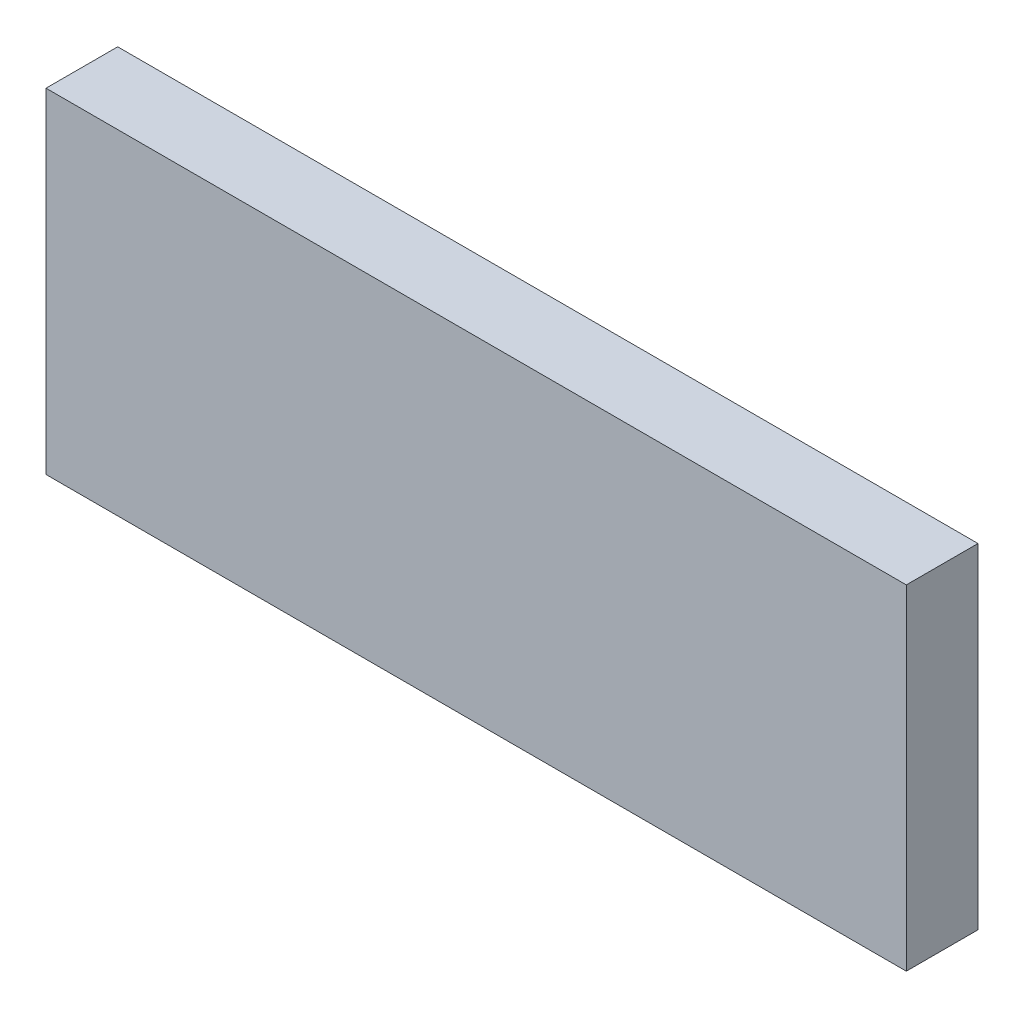
ISO-10303-21;
HEADER;
FILE_DESCRIPTION(('STEP AP214'),'2;1');
FILE_NAME('part.step','',(''),(''),'','','');
FILE_SCHEMA(('AUTOMOTIVE_DESIGN { 1 0 10303 214 1 1 1 1 }'));
ENDSEC;
DATA;
#1=APPLICATION_CONTEXT('core data for automotive mechanical design processes');
#2=APPLICATION_PROTOCOL_DEFINITION('international standard','automotive_design',2000,#1);
#3=PRODUCT_CONTEXT('',#1,'mechanical');
#4=PRODUCT('Part','Part','',(#3));
#5=PRODUCT_RELATED_PRODUCT_CATEGORY('part','',(#4));
#6=PRODUCT_DEFINITION_FORMATION('','',#4);
#7=PRODUCT_DEFINITION_CONTEXT('part definition',#1,'design');
#8=PRODUCT_DEFINITION('design','',#6,#7);
#9=PRODUCT_DEFINITION_SHAPE('','',#8);
#10=(LENGTH_UNIT() NAMED_UNIT(*) SI_UNIT(.MILLI.,.METRE.));
#11=(NAMED_UNIT(*) PLANE_ANGLE_UNIT() SI_UNIT($,.RADIAN.));
#12=(NAMED_UNIT(*) SI_UNIT($,.STERADIAN.) SOLID_ANGLE_UNIT());
#13=UNCERTAINTY_MEASURE_WITH_UNIT(LENGTH_MEASURE(1.E-05),#10,'distance_accuracy_value','');
#14=(GEOMETRIC_REPRESENTATION_CONTEXT(3) GLOBAL_UNCERTAINTY_ASSIGNED_CONTEXT((#13)) GLOBAL_UNIT_ASSIGNED_CONTEXT((#10,
#11,#12)) REPRESENTATION_CONTEXT('',''));
#15=CARTESIAN_POINT('',(0.,0.,0.));
#16=DIRECTION('',(0.,0.,1.));
#17=DIRECTION('',(1.,0.,0.));
#18=AXIS2_PLACEMENT_3D('',#15,#16,#17);
#19=CARTESIAN_POINT('',(1.270000012657E-06,0.,0.1499997));
#20=DIRECTION('',(0.,0.,1.));
#21=DIRECTION('',(1.,0.,0.));
#22=AXIS2_PLACEMENT_3D('',#19,#20,#21);
#23=PLANE('',#22);
#24=DIRECTION('',(-3.62857872202151E-06,0.999999999993417,0.));
#25=VECTOR('',#24,1.);
#26=CARTESIAN_POINT('',(0.90000328,-0.3499993,0.1499997));
#27=LINE('',#26,#25);
#28=CARTESIAN_POINT('',(0.90000328,-0.3499993,0.1499997));
#29=VERTEX_POINT('',#28);
#30=CARTESIAN_POINT('',(0.90000074,0.3499993,0.1499997));
#31=VERTEX_POINT('',#30);
#32=EDGE_CURVE('E86',#29,#31,#27,.T.);
#33=ORIENTED_EDGE('',*,*,#32,.T.);
#34=DIRECTION('',(-1.,0.,0.));
#35=VECTOR('',#34,1.);
#36=CARTESIAN_POINT('',(0.90000074,0.3499993,0.1499997));
#37=LINE('',#36,#35);
#38=CARTESIAN_POINT('',(-0.90000074,0.3499993,0.1499997));
#39=VERTEX_POINT('',#38);
#40=EDGE_CURVE('E75',#31,#39,#37,.T.);
#41=ORIENTED_EDGE('',*,*,#40,.T.);
#42=DIRECTION('',(3.62857872202151E-06,-0.999999999993417,0.));
#43=VECTOR('',#42,1.);
#44=CARTESIAN_POINT('',(-0.90000074,0.3499993,0.1499997));
#45=LINE('',#44,#43);
#46=CARTESIAN_POINT('',(-0.8999982,-0.3499993,0.1499997));
#47=VERTEX_POINT('',#46);
#48=EDGE_CURVE('E108',#39,#47,#45,.T.);
#49=ORIENTED_EDGE('',*,*,#48,.T.);
#50=DIRECTION('',(1.,0.,0.));
#51=VECTOR('',#50,1.);
#52=CARTESIAN_POINT('',(-0.8999982,-0.3499993,0.1499997));
#53=LINE('',#52,#51);
#54=EDGE_CURVE('E11',#47,#29,#53,.T.);
#55=ORIENTED_EDGE('',*,*,#54,.T.);
#56=EDGE_LOOP('',(#33,#41,#49,#55));
#57=FACE_BOUND('',#56,.T.);
#58=ADVANCED_FACE('F16',(#57),#23,.T.);
#59=CARTESIAN_POINT('',(1.270000012657E-06,0.,0.));
#60=DIRECTION('',(0.,0.,1.));
#61=DIRECTION('',(1.,0.,0.));
#62=AXIS2_PLACEMENT_3D('',#59,#60,#61);
#63=PLANE('',#62);
#64=DIRECTION('',(-3.62857872202151E-06,0.999999999993417,0.));
#65=VECTOR('',#64,1.);
#66=CARTESIAN_POINT('',(0.90000328,-0.3499993,0.));
#67=LINE('',#66,#65);
#68=CARTESIAN_POINT('',(0.90000328,-0.3499993,0.));
#69=VERTEX_POINT('',#68);
#70=CARTESIAN_POINT('',(0.90000074,0.3499993,0.));
#71=VERTEX_POINT('',#70);
#72=EDGE_CURVE('E92',#69,#71,#67,.T.);
#73=ORIENTED_EDGE('',*,*,#72,.F.);
#74=DIRECTION('',(1.,0.,0.));
#75=VECTOR('',#74,1.);
#76=CARTESIAN_POINT('',(-0.8999982,-0.3499993,0.));
#77=LINE('',#76,#75);
#78=CARTESIAN_POINT('',(-0.8999982,-0.3499993,0.));
#79=VERTEX_POINT('',#78);
#80=EDGE_CURVE('E20',#79,#69,#77,.T.);
#81=ORIENTED_EDGE('',*,*,#80,.F.);
#82=DIRECTION('',(3.62857872202151E-06,-0.999999999993417,0.));
#83=VECTOR('',#82,1.);
#84=CARTESIAN_POINT('',(-0.90000074,0.3499993,0.));
#85=LINE('',#84,#83);
#86=CARTESIAN_POINT('',(-0.90000074,0.3499993,0.));
#87=VERTEX_POINT('',#86);
#88=EDGE_CURVE('E84',#87,#79,#85,.T.);
#89=ORIENTED_EDGE('',*,*,#88,.F.);
#90=DIRECTION('',(-1.,0.,0.));
#91=VECTOR('',#90,1.);
#92=CARTESIAN_POINT('',(0.90000074,0.3499993,0.));
#93=LINE('',#92,#91);
#94=EDGE_CURVE('E90',#71,#87,#93,.T.);
#95=ORIENTED_EDGE('',*,*,#94,.F.);
#96=EDGE_LOOP('',(#73,#81,#89,#95));
#97=FACE_BOUND('',#96,.T.);
#98=ADVANCED_FACE('F119',(#97),#63,.F.);
#99=CARTESIAN_POINT('',(-0.8999982,-0.3499993,0.));
#100=DIRECTION('',(0.,1.,0.));
#101=DIRECTION('',(1.,0.,0.));
#102=AXIS2_PLACEMENT_3D('',#99,#100,#101);
#103=PLANE('',#102);
#104=DIRECTION('',(0.,0.,1.));
#105=VECTOR('',#104,1.);
#106=CARTESIAN_POINT('',(-0.8999982,-0.3499993,0.));
#107=LINE('',#106,#105);
#108=EDGE_CURVE('E105',#79,#47,#107,.T.);
#109=ORIENTED_EDGE('',*,*,#108,.F.);
#110=ORIENTED_EDGE('',*,*,#80,.T.);
#111=DIRECTION('',(0.,0.,1.));
#112=VECTOR('',#111,1.);
#113=CARTESIAN_POINT('',(0.90000328,-0.3499993,0.));
#114=LINE('',#113,#112);
#115=EDGE_CURVE('E99',#69,#29,#114,.T.);
#116=ORIENTED_EDGE('',*,*,#115,.T.);
#117=ORIENTED_EDGE('',*,*,#54,.F.);
#118=EDGE_LOOP('',(#109,#110,#116,#117));
#119=FACE_BOUND('',#118,.T.);
#120=ADVANCED_FACE('F122',(#119),#103,.F.);
#121=CARTESIAN_POINT('',(-0.90000074,0.3499993,0.));
#122=DIRECTION('',(0.999999999993417,3.62857872202151E-06,0.));
#123=DIRECTION('',(0.,0.,-1.));
#124=AXIS2_PLACEMENT_3D('',#121,#122,#123);
#125=PLANE('',#124);
#126=DIRECTION('',(0.,0.,1.));
#127=VECTOR('',#126,1.);
#128=CARTESIAN_POINT('',(-0.90000074,0.3499993,0.));
#129=LINE('',#128,#127);
#130=EDGE_CURVE('E82',#87,#39,#129,.T.);
#131=ORIENTED_EDGE('',*,*,#130,.F.);
#132=ORIENTED_EDGE('',*,*,#88,.T.);
#133=ORIENTED_EDGE('',*,*,#108,.T.);
#134=ORIENTED_EDGE('',*,*,#48,.F.);
#135=EDGE_LOOP('',(#131,#132,#133,#134));
#136=FACE_BOUND('',#135,.T.);
#137=ADVANCED_FACE('F121',(#136),#125,.F.);
#138=CARTESIAN_POINT('',(0.90000074,0.3499993,0.));
#139=DIRECTION('',(0.,-1.,0.));
#140=DIRECTION('',(0.,0.,-1.));
#141=AXIS2_PLACEMENT_3D('',#138,#139,#140);
#142=PLANE('',#141);
#143=DIRECTION('',(0.,0.,1.));
#144=VECTOR('',#143,1.);
#145=CARTESIAN_POINT('',(0.90000074,0.3499993,0.));
#146=LINE('',#145,#144);
#147=EDGE_CURVE('E79',#71,#31,#146,.T.);
#148=ORIENTED_EDGE('',*,*,#147,.F.);
#149=ORIENTED_EDGE('',*,*,#94,.T.);
#150=ORIENTED_EDGE('',*,*,#130,.T.);
#151=ORIENTED_EDGE('',*,*,#40,.F.);
#152=EDGE_LOOP('',(#148,#149,#150,#151));
#153=FACE_BOUND('',#152,.T.);
#154=ADVANCED_FACE('F76',(#153),#142,.F.);
#155=CARTESIAN_POINT('',(0.90000328,-0.3499993,0.));
#156=DIRECTION('',(-0.999999999993417,-3.62857872202151E-06,0.));
#157=DIRECTION('',(-3.62857872202151E-06,0.999999999993417,0.));
#158=AXIS2_PLACEMENT_3D('',#155,#156,#157);
#159=PLANE('',#158);
#160=ORIENTED_EDGE('',*,*,#115,.F.);
#161=ORIENTED_EDGE('',*,*,#72,.T.);
#162=ORIENTED_EDGE('',*,*,#147,.T.);
#163=ORIENTED_EDGE('',*,*,#32,.F.);
#164=EDGE_LOOP('',(#160,#161,#162,#163));
#165=FACE_BOUND('',#164,.T.);
#166=ADVANCED_FACE('F18',(#165),#159,.F.);
#167=CLOSED_SHELL('',(#58,#98,#120,#137,#154,#166));
#168=MANIFOLD_SOLID_BREP('B1',#167);
#169=ADVANCED_BREP_SHAPE_REPRESENTATION('',(#18,#168),#14);
#170=SHAPE_DEFINITION_REPRESENTATION(#9,#169);
ENDSEC;
END-ISO-10303-21;
